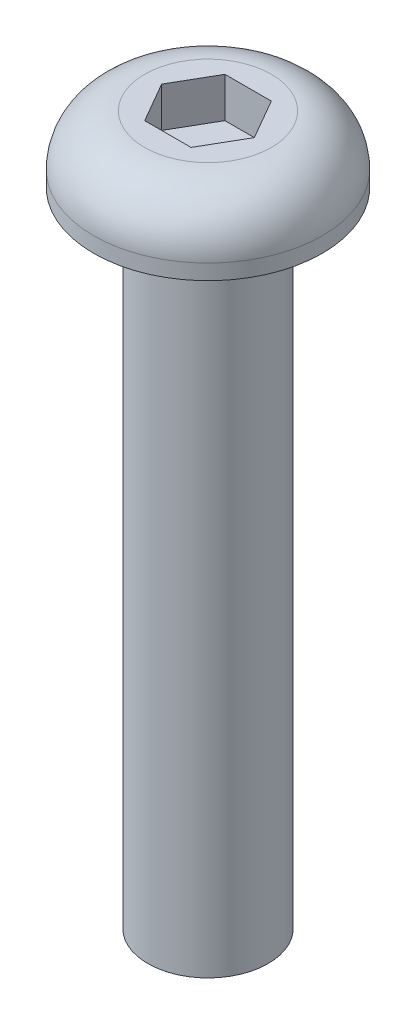
ISO-10303-21;
HEADER;
FILE_DESCRIPTION(('STEP AP214'),'2;1');
FILE_NAME('part.step','',(''),(''),'','','');
FILE_SCHEMA(('AUTOMOTIVE_DESIGN { 1 0 10303 214 1 1 1 1 }'));
ENDSEC;
DATA;
#1=APPLICATION_CONTEXT('core data for automotive mechanical design processes');
#2=APPLICATION_PROTOCOL_DEFINITION('international standard','automotive_design',2000,#1);
#3=PRODUCT_CONTEXT('',#1,'mechanical');
#4=PRODUCT('Part','Part','',(#3));
#5=PRODUCT_RELATED_PRODUCT_CATEGORY('part','',(#4));
#6=PRODUCT_DEFINITION_FORMATION('','',#4);
#7=PRODUCT_DEFINITION_CONTEXT('part definition',#1,'design');
#8=PRODUCT_DEFINITION('design','',#6,#7);
#9=PRODUCT_DEFINITION_SHAPE('','',#8);
#10=(LENGTH_UNIT() NAMED_UNIT(*) SI_UNIT(.MILLI.,.METRE.));
#11=(NAMED_UNIT(*) PLANE_ANGLE_UNIT() SI_UNIT($,.RADIAN.));
#12=(NAMED_UNIT(*) SI_UNIT($,.STERADIAN.) SOLID_ANGLE_UNIT());
#13=UNCERTAINTY_MEASURE_WITH_UNIT(LENGTH_MEASURE(1.E-05),#10,'distance_accuracy_value','');
#14=(GEOMETRIC_REPRESENTATION_CONTEXT(3) GLOBAL_UNCERTAINTY_ASSIGNED_CONTEXT((#13)) GLOBAL_UNIT_ASSIGNED_CONTEXT((#10,
#11,#12)) REPRESENTATION_CONTEXT('',''));
#15=CARTESIAN_POINT('',(0.,0.,0.));
#16=DIRECTION('',(0.,0.,1.));
#17=DIRECTION('',(1.,0.,0.));
#18=AXIS2_PLACEMENT_3D('',#15,#16,#17);
#19=CARTESIAN_POINT('',(0.,-16.,0.));
#20=DIRECTION('',(0.,-1.,0.));
#21=DIRECTION('',(0.,0.,-1.));
#22=AXIS2_PLACEMENT_3D('',#19,#20,#21);
#23=CYLINDRICAL_SURFACE('',#22,1.5);
#24=CARTESIAN_POINT('',(0.,0.,0.));
#25=DIRECTION('',(0.,-1.,0.));
#26=DIRECTION('',(0.,0.,-1.));
#27=AXIS2_PLACEMENT_3D('',#24,#25,#26);
#28=CIRCLE('',#27,1.5);
#29=CARTESIAN_POINT('',(0.,0.,-1.5));
#30=VERTEX_POINT('',#29);
#31=EDGE_CURVE('E11',#30,#30,#28,.T.);
#32=ORIENTED_EDGE('',*,*,#31,.T.);
#33=EDGE_LOOP('',(#32));
#34=FACE_BOUND('',#33,.T.);
#35=CARTESIAN_POINT('',(0.,-16.,0.));
#36=DIRECTION('',(0.,-1.,0.));
#37=DIRECTION('',(0.,0.,-1.));
#38=AXIS2_PLACEMENT_3D('',#35,#36,#37);
#39=CIRCLE('',#38,1.5);
#40=CARTESIAN_POINT('',(0.,-16.,-1.5));
#41=VERTEX_POINT('',#40);
#42=EDGE_CURVE('E168',#41,#41,#39,.T.);
#43=ORIENTED_EDGE('',*,*,#42,.F.);
#44=EDGE_LOOP('',(#43));
#45=FACE_BOUND('',#44,.T.);
#46=ADVANCED_FACE('F41',(#34,#45),#23,.T.);
#47=CARTESIAN_POINT('',(1.5,0.,0.));
#48=DIRECTION('',(0.,-1.,0.));
#49=DIRECTION('',(0.,0.,-1.));
#50=AXIS2_PLACEMENT_3D('',#47,#48,#49);
#51=PLANE('',#50);
#52=CARTESIAN_POINT('',(0.,0.,0.));
#53=DIRECTION('',(0.,-1.,0.));
#54=DIRECTION('',(0.,0.,-1.));
#55=AXIS2_PLACEMENT_3D('',#52,#53,#54);
#56=CIRCLE('',#55,2.85);
#57=CARTESIAN_POINT('',(0.,0.,-2.85));
#58=VERTEX_POINT('',#57);
#59=EDGE_CURVE('E49',#58,#58,#56,.T.);
#60=ORIENTED_EDGE('',*,*,#59,.T.);
#61=EDGE_LOOP('',(#60));
#62=FACE_BOUND('',#61,.T.);
#63=ORIENTED_EDGE('',*,*,#31,.F.);
#64=EDGE_LOOP('',(#63));
#65=FACE_BOUND('',#64,.T.);
#66=ADVANCED_FACE('F191',(#62,#65),#51,.T.);
#67=CARTESIAN_POINT('',(0.,-16.,0.));
#68=DIRECTION('',(0.,-1.,0.));
#69=DIRECTION('',(0.,0.,-1.));
#70=AXIS2_PLACEMENT_3D('',#67,#68,#69);
#71=CYLINDRICAL_SURFACE('',#70,2.85);
#72=CARTESIAN_POINT('',(0.,0.379999999999998,0.));
#73=DIRECTION('',(0.,-1.,0.));
#74=DIRECTION('',(0.,0.,-1.));
#75=AXIS2_PLACEMENT_3D('',#72,#73,#74);
#76=CIRCLE('',#75,2.85);
#77=CARTESIAN_POINT('',(0.,0.379999999999998,-2.85));
#78=VERTEX_POINT('',#77);
#79=EDGE_CURVE('E184',#78,#78,#76,.T.);
#80=ORIENTED_EDGE('',*,*,#79,.T.);
#81=EDGE_LOOP('',(#80));
#82=FACE_BOUND('',#81,.T.);
#83=ORIENTED_EDGE('',*,*,#59,.F.);
#84=EDGE_LOOP('',(#83));
#85=FACE_BOUND('',#84,.T.);
#86=ADVANCED_FACE('F194',(#82,#85),#71,.T.);
#87=CARTESIAN_POINT('',(0.,0.38,0.));
#88=DIRECTION('',(0.,-1.,0.));
#89=DIRECTION('',(0.,0.,-1.));
#90=AXIS2_PLACEMENT_3D('',#87,#88,#89);
#91=TOROIDAL_SURFACE('',#90,1.58,1.27);
#92=CARTESIAN_POINT('',(0.,1.65,0.));
#93=DIRECTION('',(0.,-1.,0.));
#94=DIRECTION('',(0.,0.,-1.));
#95=AXIS2_PLACEMENT_3D('',#92,#93,#94);
#96=CIRCLE('',#95,1.58);
#97=CARTESIAN_POINT('',(0.,1.65,-1.58));
#98=VERTEX_POINT('',#97);
#99=EDGE_CURVE('E180',#98,#98,#96,.T.);
#100=ORIENTED_EDGE('',*,*,#99,.T.);
#101=EDGE_LOOP('',(#100));
#102=FACE_BOUND('',#101,.T.);
#103=ORIENTED_EDGE('',*,*,#79,.F.);
#104=EDGE_LOOP('',(#103));
#105=FACE_BOUND('',#104,.T.);
#106=ADVANCED_FACE('F196',(#102,#105),#91,.T.);
#107=CARTESIAN_POINT('',(1.58,1.65,0.));
#108=DIRECTION('',(0.,1.,0.));
#109=DIRECTION('',(0.,0.,1.));
#110=AXIS2_PLACEMENT_3D('',#107,#108,#109);
#111=PLANE('',#110);
#112=DIRECTION('',(-0.5,0.,-0.866025403784438));
#113=VECTOR('',#112,1.);
#114=CARTESIAN_POINT('',(1.15470053837925,1.65,0.));
#115=LINE('',#114,#113);
#116=CARTESIAN_POINT('',(1.15470053837925,1.65,0.));
#117=VERTEX_POINT('',#116);
#118=CARTESIAN_POINT('',(0.577350269189626,1.65,-1.));
#119=VERTEX_POINT('',#118);
#120=EDGE_CURVE('E59',#117,#119,#115,.T.);
#121=ORIENTED_EDGE('',*,*,#120,.F.);
#122=DIRECTION('',(0.5,0.,-0.866025403784439));
#123=VECTOR('',#122,1.);
#124=CARTESIAN_POINT('',(0.577350269189626,1.65,1.));
#125=LINE('',#124,#123);
#126=CARTESIAN_POINT('',(0.577350269189626,1.65,1.));
#127=VERTEX_POINT('',#126);
#128=EDGE_CURVE('E162',#127,#117,#125,.T.);
#129=ORIENTED_EDGE('',*,*,#128,.F.);
#130=DIRECTION('',(1.,0.,0.));
#131=VECTOR('',#130,1.);
#132=CARTESIAN_POINT('',(-0.577350269189624,1.65,1.));
#133=LINE('',#132,#131);
#134=CARTESIAN_POINT('',(-0.577350269189624,1.65,1.));
#135=VERTEX_POINT('',#134);
#136=EDGE_CURVE('E159',#135,#127,#133,.T.);
#137=ORIENTED_EDGE('',*,*,#136,.F.);
#138=DIRECTION('',(0.5,0.,0.866025403784438));
#139=VECTOR('',#138,1.);
#140=CARTESIAN_POINT('',(-1.15470053837925,1.65,0.));
#141=LINE('',#140,#139);
#142=CARTESIAN_POINT('',(-1.15470053837925,1.65,0.));
#143=VERTEX_POINT('',#142);
#144=EDGE_CURVE('E116',#143,#135,#141,.T.);
#145=ORIENTED_EDGE('',*,*,#144,.F.);
#146=DIRECTION('',(-0.5,0.,0.866025403784439));
#147=VECTOR('',#146,1.);
#148=CARTESIAN_POINT('',(-0.577350269189626,1.65,-1.));
#149=LINE('',#148,#147);
#150=CARTESIAN_POINT('',(-0.577350269189626,1.65,-1.));
#151=VERTEX_POINT('',#150);
#152=EDGE_CURVE('E153',#151,#143,#149,.T.);
#153=ORIENTED_EDGE('',*,*,#152,.F.);
#154=DIRECTION('',(-1.,0.,0.));
#155=VECTOR('',#154,1.);
#156=CARTESIAN_POINT('',(0.577350269189626,1.65,-1.));
#157=LINE('',#156,#155);
#158=EDGE_CURVE('E149',#119,#151,#157,.T.);
#159=ORIENTED_EDGE('',*,*,#158,.F.);
#160=EDGE_LOOP('',(#121,#129,#137,#145,#153,#159));
#161=FACE_BOUND('',#160,.T.);
#162=ORIENTED_EDGE('',*,*,#99,.F.);
#163=EDGE_LOOP('',(#162));
#164=FACE_BOUND('',#163,.T.);
#165=ADVANCED_FACE('F203',(#161,#164),#111,.T.);
#166=CARTESIAN_POINT('',(1.5,-16.,0.));
#167=DIRECTION('',(0.,-1.,0.));
#168=DIRECTION('',(0.,0.,-1.));
#169=AXIS2_PLACEMENT_3D('',#166,#167,#168);
#170=PLANE('',#169);
#171=ORIENTED_EDGE('',*,*,#42,.T.);
#172=EDGE_LOOP('',(#171));
#173=FACE_BOUND('',#172,.T.);
#174=ADVANCED_FACE('F214',(#173),#170,.T.);
#175=CARTESIAN_POINT('',(1.15470053837925,0.65,0.));
#176=DIRECTION('',(0.866025403784438,0.,-0.5));
#177=DIRECTION('',(-0.5,0.,-0.866025403784439));
#178=AXIS2_PLACEMENT_3D('',#175,#176,#177);
#179=PLANE('',#178);
#180=ORIENTED_EDGE('',*,*,#120,.T.);
#181=DIRECTION('',(0.,1.,0.));
#182=VECTOR('',#181,1.);
#183=CARTESIAN_POINT('',(0.577350269189626,0.65,-1.));
#184=LINE('',#183,#182);
#185=CARTESIAN_POINT('',(0.577350269189626,0.65,-1.));
#186=VERTEX_POINT('',#185);
#187=EDGE_CURVE('E98',#186,#119,#184,.T.);
#188=ORIENTED_EDGE('',*,*,#187,.F.);
#189=DIRECTION('',(-0.5,0.,-0.866025403784438));
#190=VECTOR('',#189,1.);
#191=CARTESIAN_POINT('',(1.15470053837925,0.65,0.));
#192=LINE('',#191,#190);
#193=CARTESIAN_POINT('',(1.15470053837925,0.65,0.));
#194=VERTEX_POINT('',#193);
#195=EDGE_CURVE('E165',#194,#186,#192,.T.);
#196=ORIENTED_EDGE('',*,*,#195,.F.);
#197=DIRECTION('',(0.,1.,0.));
#198=VECTOR('',#197,1.);
#199=CARTESIAN_POINT('',(1.15470053837925,0.65,0.));
#200=LINE('',#199,#198);
#201=EDGE_CURVE('E69',#194,#117,#200,.T.);
#202=ORIENTED_EDGE('',*,*,#201,.T.);
#203=EDGE_LOOP('',(#180,#188,#196,#202));
#204=FACE_BOUND('',#203,.T.);
#205=ADVANCED_FACE('F216',(#204),#179,.F.);
#206=CARTESIAN_POINT('',(0.577350269189626,0.65,1.));
#207=DIRECTION('',(0.866025403784439,0.,0.5));
#208=DIRECTION('',(0.5,0.,-0.866025403784439));
#209=AXIS2_PLACEMENT_3D('',#206,#207,#208);
#210=PLANE('',#209);
#211=ORIENTED_EDGE('',*,*,#128,.T.);
#212=ORIENTED_EDGE('',*,*,#201,.F.);
#213=DIRECTION('',(0.5,0.,-0.866025403784439));
#214=VECTOR('',#213,1.);
#215=CARTESIAN_POINT('',(0.577350269189626,0.65,1.));
#216=LINE('',#215,#214);
#217=CARTESIAN_POINT('',(0.577350269189626,0.65,1.));
#218=VERTEX_POINT('',#217);
#219=EDGE_CURVE('E130',#218,#194,#216,.T.);
#220=ORIENTED_EDGE('',*,*,#219,.F.);
#221=DIRECTION('',(0.,1.,0.));
#222=VECTOR('',#221,1.);
#223=CARTESIAN_POINT('',(0.577350269189626,0.65,1.));
#224=LINE('',#223,#222);
#225=EDGE_CURVE('E121',#218,#127,#224,.T.);
#226=ORIENTED_EDGE('',*,*,#225,.T.);
#227=EDGE_LOOP('',(#211,#212,#220,#226));
#228=FACE_BOUND('',#227,.T.);
#229=ADVANCED_FACE('F222',(#228),#210,.F.);
#230=CARTESIAN_POINT('',(-0.577350269189624,0.65,1.));
#231=DIRECTION('',(0.,0.,1.));
#232=DIRECTION('',(1.,0.,0.));
#233=AXIS2_PLACEMENT_3D('',#230,#231,#232);
#234=PLANE('',#233);
#235=ORIENTED_EDGE('',*,*,#136,.T.);
#236=ORIENTED_EDGE('',*,*,#225,.F.);
#237=DIRECTION('',(1.,0.,0.));
#238=VECTOR('',#237,1.);
#239=CARTESIAN_POINT('',(-0.577350269189624,0.65,1.));
#240=LINE('',#239,#238);
#241=CARTESIAN_POINT('',(-0.577350269189624,0.65,1.));
#242=VERTEX_POINT('',#241);
#243=EDGE_CURVE('E125',#242,#218,#240,.T.);
#244=ORIENTED_EDGE('',*,*,#243,.F.);
#245=DIRECTION('',(0.,1.,0.));
#246=VECTOR('',#245,1.);
#247=CARTESIAN_POINT('',(-0.577350269189624,0.65,1.));
#248=LINE('',#247,#246);
#249=EDGE_CURVE('E109',#242,#135,#248,.T.);
#250=ORIENTED_EDGE('',*,*,#249,.T.);
#251=EDGE_LOOP('',(#235,#236,#244,#250));
#252=FACE_BOUND('',#251,.T.);
#253=ADVANCED_FACE('F126',(#252),#234,.F.);
#254=CARTESIAN_POINT('',(-1.15470053837925,0.65,0.));
#255=DIRECTION('',(-0.866025403784438,0.,0.5));
#256=DIRECTION('',(0.5,0.,0.866025403784439));
#257=AXIS2_PLACEMENT_3D('',#254,#255,#256);
#258=PLANE('',#257);
#259=ORIENTED_EDGE('',*,*,#144,.T.);
#260=ORIENTED_EDGE('',*,*,#249,.F.);
#261=DIRECTION('',(0.5,0.,0.866025403784438));
#262=VECTOR('',#261,1.);
#263=CARTESIAN_POINT('',(-1.15470053837925,0.65,0.));
#264=LINE('',#263,#262);
#265=CARTESIAN_POINT('',(-1.15470053837925,0.65,0.));
#266=VERTEX_POINT('',#265);
#267=EDGE_CURVE('E113',#266,#242,#264,.T.);
#268=ORIENTED_EDGE('',*,*,#267,.F.);
#269=DIRECTION('',(0.,1.,0.));
#270=VECTOR('',#269,1.);
#271=CARTESIAN_POINT('',(-1.15470053837925,0.65,0.));
#272=LINE('',#271,#270);
#273=EDGE_CURVE('E122',#266,#143,#272,.T.);
#274=ORIENTED_EDGE('',*,*,#273,.T.);
#275=EDGE_LOOP('',(#259,#260,#268,#274));
#276=FACE_BOUND('',#275,.T.);
#277=ADVANCED_FACE('F111',(#276),#258,.F.);
#278=CARTESIAN_POINT('',(-0.577350269189626,0.65,-1.));
#279=DIRECTION('',(-0.866025403784439,0.,-0.5));
#280=DIRECTION('',(-0.5,0.,0.866025403784439));
#281=AXIS2_PLACEMENT_3D('',#278,#279,#280);
#282=PLANE('',#281);
#283=ORIENTED_EDGE('',*,*,#152,.T.);
#284=ORIENTED_EDGE('',*,*,#273,.F.);
#285=DIRECTION('',(-0.5,0.,0.866025403784439));
#286=VECTOR('',#285,1.);
#287=CARTESIAN_POINT('',(-0.577350269189626,0.65,-1.));
#288=LINE('',#287,#286);
#289=CARTESIAN_POINT('',(-0.577350269189626,0.65,-1.));
#290=VERTEX_POINT('',#289);
#291=EDGE_CURVE('E136',#290,#266,#288,.T.);
#292=ORIENTED_EDGE('',*,*,#291,.F.);
#293=DIRECTION('',(0.,1.,0.));
#294=VECTOR('',#293,1.);
#295=CARTESIAN_POINT('',(-0.577350269189626,0.65,-1.));
#296=LINE('',#295,#294);
#297=EDGE_CURVE('E172',#290,#151,#296,.T.);
#298=ORIENTED_EDGE('',*,*,#297,.T.);
#299=EDGE_LOOP('',(#283,#284,#292,#298));
#300=FACE_BOUND('',#299,.T.);
#301=ADVANCED_FACE('F230',(#300),#282,.F.);
#302=CARTESIAN_POINT('',(0.577350269189626,0.65,-1.));
#303=DIRECTION('',(0.,0.,-1.));
#304=DIRECTION('',(-1.,0.,0.));
#305=AXIS2_PLACEMENT_3D('',#302,#303,#304);
#306=PLANE('',#305);
#307=ORIENTED_EDGE('',*,*,#158,.T.);
#308=ORIENTED_EDGE('',*,*,#297,.F.);
#309=DIRECTION('',(-1.,0.,0.));
#310=VECTOR('',#309,1.);
#311=CARTESIAN_POINT('',(0.577350269189626,0.65,-1.));
#312=LINE('',#311,#310);
#313=EDGE_CURVE('E142',#186,#290,#312,.T.);
#314=ORIENTED_EDGE('',*,*,#313,.F.);
#315=ORIENTED_EDGE('',*,*,#187,.T.);
#316=EDGE_LOOP('',(#307,#308,#314,#315));
#317=FACE_BOUND('',#316,.T.);
#318=ADVANCED_FACE('F227',(#317),#306,.F.);
#319=CARTESIAN_POINT('',(0.,0.65,0.));
#320=DIRECTION('',(0.,1.,0.));
#321=DIRECTION('',(0.,0.,1.));
#322=AXIS2_PLACEMENT_3D('',#319,#320,#321);
#323=PLANE('',#322);
#324=ORIENTED_EDGE('',*,*,#195,.T.);
#325=ORIENTED_EDGE('',*,*,#313,.T.);
#326=ORIENTED_EDGE('',*,*,#291,.T.);
#327=ORIENTED_EDGE('',*,*,#267,.T.);
#328=ORIENTED_EDGE('',*,*,#243,.T.);
#329=ORIENTED_EDGE('',*,*,#219,.T.);
#330=EDGE_LOOP('',(#324,#325,#326,#327,#328,#329));
#331=FACE_BOUND('',#330,.T.);
#332=ADVANCED_FACE('F133',(#331),#323,.T.);
#333=CLOSED_SHELL('',(#46,#66,#86,#106,#165,#174,#205,#229,#253,#277,#301,#318,#332));
#334=MANIFOLD_SOLID_BREP('B2',#333);
#335=ADVANCED_BREP_SHAPE_REPRESENTATION('',(#18,#334),#14);
#336=SHAPE_DEFINITION_REPRESENTATION(#9,#335);
ENDSEC;
END-ISO-10303-21;
